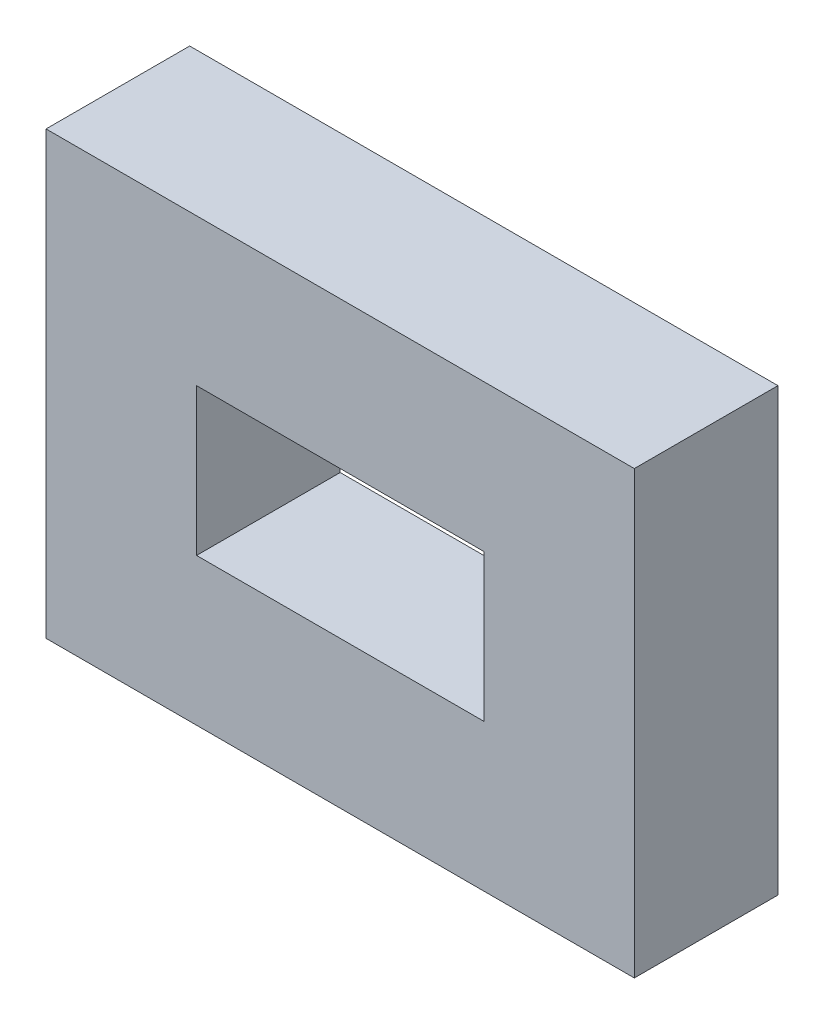
ISO-10303-21;
HEADER;
FILE_DESCRIPTION(('STEP AP214'),'2;1');
FILE_NAME('part.step','',(''),(''),'','','');
FILE_SCHEMA(('AUTOMOTIVE_DESIGN { 1 0 10303 214 1 1 1 1 }'));
ENDSEC;
DATA;
#1=APPLICATION_CONTEXT('core data for automotive mechanical design processes');
#2=APPLICATION_PROTOCOL_DEFINITION('international standard','automotive_design',2000,#1);
#3=PRODUCT_CONTEXT('',#1,'mechanical');
#4=PRODUCT('Part','Part','',(#3));
#5=PRODUCT_RELATED_PRODUCT_CATEGORY('part','',(#4));
#6=PRODUCT_DEFINITION_FORMATION('','',#4);
#7=PRODUCT_DEFINITION_CONTEXT('part definition',#1,'design');
#8=PRODUCT_DEFINITION('design','',#6,#7);
#9=PRODUCT_DEFINITION_SHAPE('','',#8);
#10=(LENGTH_UNIT() NAMED_UNIT(*) SI_UNIT(.MILLI.,.METRE.));
#11=(NAMED_UNIT(*) PLANE_ANGLE_UNIT() SI_UNIT($,.RADIAN.));
#12=(NAMED_UNIT(*) SI_UNIT($,.STERADIAN.) SOLID_ANGLE_UNIT());
#13=UNCERTAINTY_MEASURE_WITH_UNIT(LENGTH_MEASURE(1.E-05),#10,'distance_accuracy_value','');
#14=(GEOMETRIC_REPRESENTATION_CONTEXT(3) GLOBAL_UNCERTAINTY_ASSIGNED_CONTEXT((#13)) GLOBAL_UNIT_ASSIGNED_CONTEXT((#10,
#11,#12)) REPRESENTATION_CONTEXT('',''));
#15=CARTESIAN_POINT('',(0.,0.,0.));
#16=DIRECTION('',(0.,0.,1.));
#17=DIRECTION('',(1.,0.,0.));
#18=AXIS2_PLACEMENT_3D('',#15,#16,#17);
#19=CARTESIAN_POINT('',(10.16,7.62,4.9609375));
#20=DIRECTION('',(-1.,0.,0.));
#21=DIRECTION('',(0.,-1.,0.));
#22=AXIS2_PLACEMENT_3D('',#19,#20,#21);
#23=PLANE('',#22);
#24=DIRECTION('',(0.,1.,0.));
#25=VECTOR('',#24,1.);
#26=CARTESIAN_POINT('',(10.16,7.62,0.));
#27=LINE('',#26,#25);
#28=CARTESIAN_POINT('',(10.16,-7.62,0.));
#29=VERTEX_POINT('',#28);
#30=CARTESIAN_POINT('',(10.16,7.62,0.));
#31=VERTEX_POINT('',#30);
#32=EDGE_CURVE('E130',#29,#31,#27,.T.);
#33=ORIENTED_EDGE('',*,*,#32,.T.);
#34=DIRECTION('',(0.,0.,-1.));
#35=VECTOR('',#34,1.);
#36=CARTESIAN_POINT('',(10.16,7.62,4.9609375));
#37=LINE('',#36,#35);
#38=CARTESIAN_POINT('',(10.16,7.62,4.9609375));
#39=VERTEX_POINT('',#38);
#40=EDGE_CURVE('E11',#39,#31,#37,.T.);
#41=ORIENTED_EDGE('',*,*,#40,.F.);
#42=DIRECTION('',(0.,1.,0.));
#43=VECTOR('',#42,1.);
#44=CARTESIAN_POINT('',(10.16,7.62,4.9609375));
#45=LINE('',#44,#43);
#46=CARTESIAN_POINT('',(10.16,-7.62,4.9609375));
#47=VERTEX_POINT('',#46);
#48=EDGE_CURVE('E131',#47,#39,#45,.T.);
#49=ORIENTED_EDGE('',*,*,#48,.F.);
#50=DIRECTION('',(0.,0.,-1.));
#51=VECTOR('',#50,1.);
#52=CARTESIAN_POINT('',(10.16,-7.62,4.9609375));
#53=LINE('',#52,#51);
#54=EDGE_CURVE('E141',#47,#29,#53,.T.);
#55=ORIENTED_EDGE('',*,*,#54,.T.);
#56=EDGE_LOOP('',(#33,#41,#49,#55));
#57=FACE_BOUND('',#56,.T.);
#58=ADVANCED_FACE('F33',(#57),#23,.F.);
#59=CARTESIAN_POINT('',(-10.16,7.62,4.9609375));
#60=DIRECTION('',(0.,-1.,0.));
#61=DIRECTION('',(0.,0.,-1.));
#62=AXIS2_PLACEMENT_3D('',#59,#60,#61);
#63=PLANE('',#62);
#64=DIRECTION('',(-1.,0.,0.));
#65=VECTOR('',#64,1.);
#66=CARTESIAN_POINT('',(-10.16,7.62,0.));
#67=LINE('',#66,#65);
#68=CARTESIAN_POINT('',(-10.16,7.62,0.));
#69=VERTEX_POINT('',#68);
#70=EDGE_CURVE('E144',#31,#69,#67,.T.);
#71=ORIENTED_EDGE('',*,*,#70,.T.);
#72=DIRECTION('',(0.,0.,-1.));
#73=VECTOR('',#72,1.);
#74=CARTESIAN_POINT('',(-10.16,7.62,4.9609375));
#75=LINE('',#74,#73);
#76=CARTESIAN_POINT('',(-10.16,7.62,4.9609375));
#77=VERTEX_POINT('',#76);
#78=EDGE_CURVE('E40',#77,#69,#75,.T.);
#79=ORIENTED_EDGE('',*,*,#78,.F.);
#80=DIRECTION('',(-1.,0.,0.));
#81=VECTOR('',#80,1.);
#82=CARTESIAN_POINT('',(-10.16,7.62,4.9609375));
#83=LINE('',#82,#81);
#84=EDGE_CURVE('E134',#39,#77,#83,.T.);
#85=ORIENTED_EDGE('',*,*,#84,.F.);
#86=ORIENTED_EDGE('',*,*,#40,.T.);
#87=EDGE_LOOP('',(#71,#79,#85,#86));
#88=FACE_BOUND('',#87,.T.);
#89=ADVANCED_FACE('F172',(#88),#63,.F.);
#90=CARTESIAN_POINT('',(-10.16,7.62,4.9609375));
#91=DIRECTION('',(1.,0.,0.));
#92=DIRECTION('',(0.,0.,-1.));
#93=AXIS2_PLACEMENT_3D('',#90,#91,#92);
#94=PLANE('',#93);
#95=DIRECTION('',(0.,-1.,0.));
#96=VECTOR('',#95,1.);
#97=CARTESIAN_POINT('',(-10.16,7.62,0.));
#98=LINE('',#97,#96);
#99=CARTESIAN_POINT('',(-10.16,-7.62,0.));
#100=VERTEX_POINT('',#99);
#101=EDGE_CURVE('E146',#69,#100,#98,.T.);
#102=ORIENTED_EDGE('',*,*,#101,.T.);
#103=DIRECTION('',(0.,0.,-1.));
#104=VECTOR('',#103,1.);
#105=CARTESIAN_POINT('',(-10.16,-7.62,4.9609375));
#106=LINE('',#105,#104);
#107=CARTESIAN_POINT('',(-10.16,-7.62,4.9609375));
#108=VERTEX_POINT('',#107);
#109=EDGE_CURVE('E151',#108,#100,#106,.T.);
#110=ORIENTED_EDGE('',*,*,#109,.F.);
#111=DIRECTION('',(0.,-1.,0.));
#112=VECTOR('',#111,1.);
#113=CARTESIAN_POINT('',(-10.16,7.62,4.9609375));
#114=LINE('',#113,#112);
#115=EDGE_CURVE('E137',#77,#108,#114,.T.);
#116=ORIENTED_EDGE('',*,*,#115,.F.);
#117=ORIENTED_EDGE('',*,*,#78,.T.);
#118=EDGE_LOOP('',(#102,#110,#116,#117));
#119=FACE_BOUND('',#118,.T.);
#120=ADVANCED_FACE('F158',(#119),#94,.F.);
#121=CARTESIAN_POINT('',(-10.16,-7.62,4.9609375));
#122=DIRECTION('',(0.,1.,0.));
#123=DIRECTION('',(0.,0.,1.));
#124=AXIS2_PLACEMENT_3D('',#121,#122,#123);
#125=PLANE('',#124);
#126=DIRECTION('',(1.,0.,0.));
#127=VECTOR('',#126,1.);
#128=CARTESIAN_POINT('',(-10.16,-7.62,0.));
#129=LINE('',#128,#127);
#130=EDGE_CURVE('E135',#100,#29,#129,.T.);
#131=ORIENTED_EDGE('',*,*,#130,.T.);
#132=ORIENTED_EDGE('',*,*,#54,.F.);
#133=DIRECTION('',(1.,0.,0.));
#134=VECTOR('',#133,1.);
#135=CARTESIAN_POINT('',(-10.16,-7.62,4.9609375));
#136=LINE('',#135,#134);
#137=EDGE_CURVE('E139',#108,#47,#136,.T.);
#138=ORIENTED_EDGE('',*,*,#137,.F.);
#139=ORIENTED_EDGE('',*,*,#109,.T.);
#140=EDGE_LOOP('',(#131,#132,#138,#139));
#141=FACE_BOUND('',#140,.T.);
#142=ADVANCED_FACE('F167',(#141),#125,.F.);
#143=CARTESIAN_POINT('',(0.,0.,4.9609375));
#144=DIRECTION('',(0.,0.,1.));
#145=DIRECTION('',(1.,0.,0.));
#146=AXIS2_PLACEMENT_3D('',#143,#144,#145);
#147=PLANE('',#146);
#148=DIRECTION('',(0.,1.,0.));
#149=VECTOR('',#148,1.);
#150=CARTESIAN_POINT('',(4.9609375,0.,4.9609375));
#151=LINE('',#150,#149);
#152=CARTESIAN_POINT('',(4.9609375,-2.54,4.9609375));
#153=VERTEX_POINT('',#152);
#154=CARTESIAN_POINT('',(4.9609375,2.54,4.9609375));
#155=VERTEX_POINT('',#154);
#156=EDGE_CURVE('E99',#153,#155,#151,.T.);
#157=ORIENTED_EDGE('',*,*,#156,.F.);
#158=DIRECTION('',(-1.,0.,0.));
#159=VECTOR('',#158,1.);
#160=CARTESIAN_POINT('',(4.9609375,-2.54,4.9609375));
#161=LINE('',#160,#159);
#162=CARTESIAN_POINT('',(-4.9609375,-2.54,4.9609375));
#163=VERTEX_POINT('',#162);
#164=EDGE_CURVE('E105',#153,#163,#161,.T.);
#165=ORIENTED_EDGE('',*,*,#164,.T.);
#166=DIRECTION('',(0.,1.,0.));
#167=VECTOR('',#166,1.);
#168=CARTESIAN_POINT('',(-4.9609375,0.,4.9609375));
#169=LINE('',#168,#167);
#170=CARTESIAN_POINT('',(-4.9609375,2.54,4.9609375));
#171=VERTEX_POINT('',#170);
#172=EDGE_CURVE('E94',#163,#171,#169,.T.);
#173=ORIENTED_EDGE('',*,*,#172,.T.);
#174=DIRECTION('',(1.,0.,0.));
#175=VECTOR('',#174,1.);
#176=CARTESIAN_POINT('',(4.9609375,2.54,4.9609375));
#177=LINE('',#176,#175);
#178=EDGE_CURVE('E115',#171,#155,#177,.T.);
#179=ORIENTED_EDGE('',*,*,#178,.T.);
#180=EDGE_LOOP('',(#157,#165,#173,#179));
#181=FACE_BOUND('',#180,.T.);
#182=ORIENTED_EDGE('',*,*,#137,.T.);
#183=ORIENTED_EDGE('',*,*,#48,.T.);
#184=ORIENTED_EDGE('',*,*,#84,.T.);
#185=ORIENTED_EDGE('',*,*,#115,.T.);
#186=EDGE_LOOP('',(#182,#183,#184,#185));
#187=FACE_BOUND('',#186,.T.);
#188=ADVANCED_FACE('F112',(#181,#187),#147,.T.);
#189=CARTESIAN_POINT('',(0.,0.,0.));
#190=DIRECTION('',(0.,0.,1.));
#191=DIRECTION('',(1.,0.,0.));
#192=AXIS2_PLACEMENT_3D('',#189,#190,#191);
#193=PLANE('',#192);
#194=DIRECTION('',(-1.,0.,0.));
#195=VECTOR('',#194,1.);
#196=CARTESIAN_POINT('',(4.9609375,-2.54,0.));
#197=LINE('',#196,#195);
#198=CARTESIAN_POINT('',(4.9609375,-2.54,0.));
#199=VERTEX_POINT('',#198);
#200=CARTESIAN_POINT('',(-4.9609375,-2.54,0.));
#201=VERTEX_POINT('',#200);
#202=EDGE_CURVE('E108',#199,#201,#197,.T.);
#203=ORIENTED_EDGE('',*,*,#202,.F.);
#204=DIRECTION('',(0.,-1.,0.));
#205=VECTOR('',#204,1.);
#206=CARTESIAN_POINT('',(4.9609375,7.62,0.));
#207=LINE('',#206,#205);
#208=CARTESIAN_POINT('',(4.9609375,2.54,0.));
#209=VERTEX_POINT('',#208);
#210=EDGE_CURVE('E100',#209,#199,#207,.T.);
#211=ORIENTED_EDGE('',*,*,#210,.F.);
#212=DIRECTION('',(1.,0.,0.));
#213=VECTOR('',#212,1.);
#214=CARTESIAN_POINT('',(4.9609375,2.54,0.));
#215=LINE('',#214,#213);
#216=CARTESIAN_POINT('',(-4.9609375,2.54,0.));
#217=VERTEX_POINT('',#216);
#218=EDGE_CURVE('E122',#217,#209,#215,.T.);
#219=ORIENTED_EDGE('',*,*,#218,.F.);
#220=DIRECTION('',(0.,1.,0.));
#221=VECTOR('',#220,1.);
#222=CARTESIAN_POINT('',(-4.9609375,7.62,0.));
#223=LINE('',#222,#221);
#224=EDGE_CURVE('E110',#201,#217,#223,.T.);
#225=ORIENTED_EDGE('',*,*,#224,.F.);
#226=EDGE_LOOP('',(#203,#211,#219,#225));
#227=FACE_BOUND('',#226,.T.);
#228=ORIENTED_EDGE('',*,*,#32,.F.);
#229=ORIENTED_EDGE('',*,*,#130,.F.);
#230=ORIENTED_EDGE('',*,*,#101,.F.);
#231=ORIENTED_EDGE('',*,*,#70,.F.);
#232=EDGE_LOOP('',(#228,#229,#230,#231));
#233=FACE_BOUND('',#232,.T.);
#234=ADVANCED_FACE('F164',(#227,#233),#193,.F.);
#235=CARTESIAN_POINT('',(4.9609375,-20.955,28.321));
#236=DIRECTION('',(1.,0.,0.));
#237=DIRECTION('',(0.,0.,-1.));
#238=AXIS2_PLACEMENT_3D('',#235,#236,#237);
#239=PLANE('',#238);
#240=ORIENTED_EDGE('',*,*,#156,.T.);
#241=DIRECTION('',(0.,0.,-1.));
#242=VECTOR('',#241,1.);
#243=CARTESIAN_POINT('',(4.9609375,2.54,4.9609375));
#244=LINE('',#243,#242);
#245=EDGE_CURVE('E114',#155,#209,#244,.T.);
#246=ORIENTED_EDGE('',*,*,#245,.T.);
#247=ORIENTED_EDGE('',*,*,#210,.T.);
#248=DIRECTION('',(0.,0.,-1.));
#249=VECTOR('',#248,1.);
#250=CARTESIAN_POINT('',(4.9609375,-2.54,4.9609375));
#251=LINE('',#250,#249);
#252=EDGE_CURVE('E117',#153,#199,#251,.T.);
#253=ORIENTED_EDGE('',*,*,#252,.F.);
#254=EDGE_LOOP('',(#240,#246,#247,#253));
#255=FACE_BOUND('',#254,.T.);
#256=ADVANCED_FACE('F184',(#255),#239,.F.);
#257=CARTESIAN_POINT('',(4.9609375,2.54,4.9609375));
#258=DIRECTION('',(0.,1.,0.));
#259=DIRECTION('',(0.,0.,1.));
#260=AXIS2_PLACEMENT_3D('',#257,#258,#259);
#261=PLANE('',#260);
#262=ORIENTED_EDGE('',*,*,#218,.T.);
#263=ORIENTED_EDGE('',*,*,#245,.F.);
#264=ORIENTED_EDGE('',*,*,#178,.F.);
#265=DIRECTION('',(0.,0.,-1.));
#266=VECTOR('',#265,1.);
#267=CARTESIAN_POINT('',(-4.9609375,2.54,4.9609375));
#268=LINE('',#267,#266);
#269=EDGE_CURVE('E47',#171,#217,#268,.T.);
#270=ORIENTED_EDGE('',*,*,#269,.T.);
#271=EDGE_LOOP('',(#262,#263,#264,#270));
#272=FACE_BOUND('',#271,.T.);
#273=ADVANCED_FACE('F190',(#272),#261,.F.);
#274=CARTESIAN_POINT('',(4.9609375,-2.54,4.9609375));
#275=DIRECTION('',(0.,-1.,0.));
#276=DIRECTION('',(0.,0.,-1.));
#277=AXIS2_PLACEMENT_3D('',#274,#275,#276);
#278=PLANE('',#277);
#279=ORIENTED_EDGE('',*,*,#202,.T.);
#280=DIRECTION('',(0.,0.,-1.));
#281=VECTOR('',#280,1.);
#282=CARTESIAN_POINT('',(-4.9609375,-2.54,4.9609375));
#283=LINE('',#282,#281);
#284=EDGE_CURVE('E52',#163,#201,#283,.T.);
#285=ORIENTED_EDGE('',*,*,#284,.F.);
#286=ORIENTED_EDGE('',*,*,#164,.F.);
#287=ORIENTED_EDGE('',*,*,#252,.T.);
#288=EDGE_LOOP('',(#279,#285,#286,#287));
#289=FACE_BOUND('',#288,.T.);
#290=ADVANCED_FACE('F104',(#289),#278,.F.);
#291=CARTESIAN_POINT('',(-4.9609375,-20.955,28.321));
#292=DIRECTION('',(1.,0.,0.));
#293=DIRECTION('',(0.,0.,-1.));
#294=AXIS2_PLACEMENT_3D('',#291,#292,#293);
#295=PLANE('',#294);
#296=ORIENTED_EDGE('',*,*,#284,.T.);
#297=ORIENTED_EDGE('',*,*,#224,.T.);
#298=ORIENTED_EDGE('',*,*,#269,.F.);
#299=ORIENTED_EDGE('',*,*,#172,.F.);
#300=EDGE_LOOP('',(#296,#297,#298,#299));
#301=FACE_BOUND('',#300,.T.);
#302=ADVANCED_FACE('F95',(#301),#295,.T.);
#303=CLOSED_SHELL('',(#58,#89,#120,#142,#188,#234,#256,#273,#290,#302));
#304=MANIFOLD_SOLID_BREP('B2',#303);
#305=ADVANCED_BREP_SHAPE_REPRESENTATION('',(#18,#304),#14);
#306=SHAPE_DEFINITION_REPRESENTATION(#9,#305);
ENDSEC;
END-ISO-10303-21;
